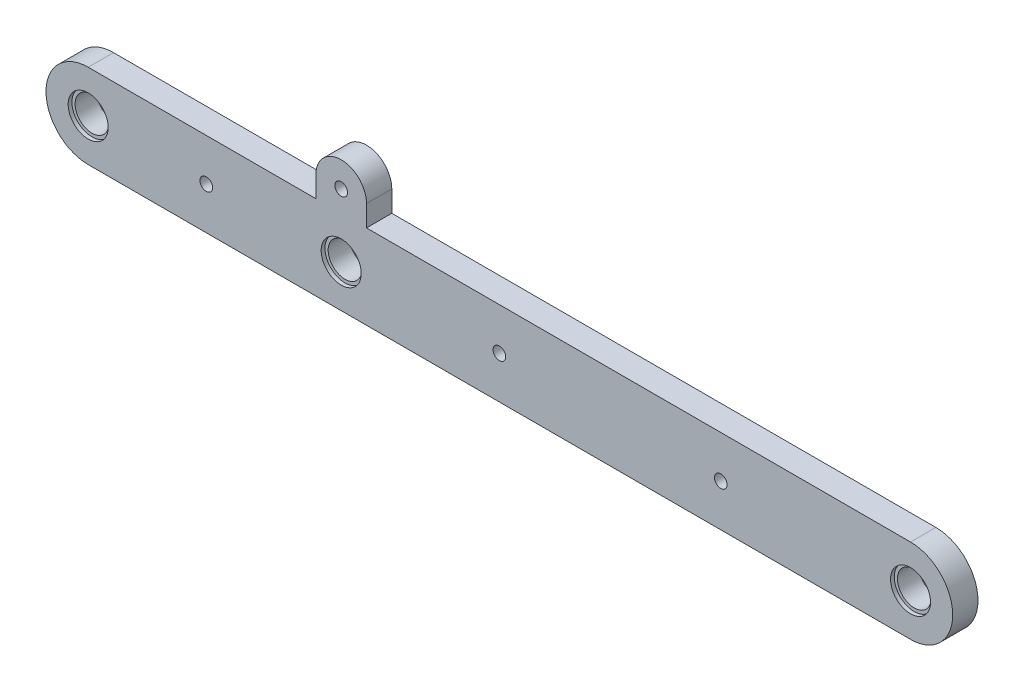
ISO-10303-21;
HEADER;
FILE_DESCRIPTION(('STEP AP214'),'2;1');
FILE_NAME('part.step','',(''),(''),'','','');
FILE_SCHEMA(('AUTOMOTIVE_DESIGN { 1 0 10303 214 1 1 1 1 }'));
ENDSEC;
DATA;
#1=APPLICATION_CONTEXT('core data for automotive mechanical design processes');
#2=APPLICATION_PROTOCOL_DEFINITION('international standard','automotive_design',2000,#1);
#3=PRODUCT_CONTEXT('',#1,'mechanical');
#4=PRODUCT('Part','Part','',(#3));
#5=PRODUCT_RELATED_PRODUCT_CATEGORY('part','',(#4));
#6=PRODUCT_DEFINITION_FORMATION('','',#4);
#7=PRODUCT_DEFINITION_CONTEXT('part definition',#1,'design');
#8=PRODUCT_DEFINITION('design','',#6,#7);
#9=PRODUCT_DEFINITION_SHAPE('','',#8);
#10=(LENGTH_UNIT() NAMED_UNIT(*) SI_UNIT(.MILLI.,.METRE.));
#11=(NAMED_UNIT(*) PLANE_ANGLE_UNIT() SI_UNIT($,.RADIAN.));
#12=(NAMED_UNIT(*) SI_UNIT($,.STERADIAN.) SOLID_ANGLE_UNIT());
#13=UNCERTAINTY_MEASURE_WITH_UNIT(LENGTH_MEASURE(1.E-05),#10,'distance_accuracy_value','');
#14=(GEOMETRIC_REPRESENTATION_CONTEXT(3) GLOBAL_UNCERTAINTY_ASSIGNED_CONTEXT((#13)) GLOBAL_UNIT_ASSIGNED_CONTEXT((#10,
#11,#12)) REPRESENTATION_CONTEXT('',''));
#15=CARTESIAN_POINT('',(0.,0.,0.));
#16=DIRECTION('',(0.,0.,1.));
#17=DIRECTION('',(1.,0.,0.));
#18=AXIS2_PLACEMENT_3D('',#15,#16,#17);
#19=CARTESIAN_POINT('',(6.,0.,6.));
#20=DIRECTION('',(-1.,0.,0.));
#21=DIRECTION('',(0.,-1.,0.));
#22=AXIS2_PLACEMENT_3D('',#19,#20,#21);
#23=PLANE('',#22);
#24=DIRECTION('',(0.,1.,0.));
#25=VECTOR('',#24,1.);
#26=CARTESIAN_POINT('',(6.,0.,0.));
#27=LINE('',#26,#25);
#28=CARTESIAN_POINT('',(6.,10.,0.));
#29=VERTEX_POINT('',#28);
#30=CARTESIAN_POINT('',(6.,15.,0.));
#31=VERTEX_POINT('',#30);
#32=EDGE_CURVE('E231',#29,#31,#27,.T.);
#33=ORIENTED_EDGE('',*,*,#32,.T.);
#34=DIRECTION('',(0.,0.,-1.));
#35=VECTOR('',#34,1.);
#36=CARTESIAN_POINT('',(6.,15.,6.));
#37=LINE('',#36,#35);
#38=CARTESIAN_POINT('',(6.,15.,6.));
#39=VERTEX_POINT('',#38);
#40=EDGE_CURVE('E176',#39,#31,#37,.T.);
#41=ORIENTED_EDGE('',*,*,#40,.F.);
#42=DIRECTION('',(0.,1.,0.));
#43=VECTOR('',#42,1.);
#44=CARTESIAN_POINT('',(6.,0.,6.));
#45=LINE('',#44,#43);
#46=CARTESIAN_POINT('',(6.,10.,6.));
#47=VERTEX_POINT('',#46);
#48=EDGE_CURVE('E286',#47,#39,#45,.T.);
#49=ORIENTED_EDGE('',*,*,#48,.F.);
#50=DIRECTION('',(0.,0.,-1.));
#51=VECTOR('',#50,1.);
#52=CARTESIAN_POINT('',(6.,10.,6.));
#53=LINE('',#52,#51);
#54=EDGE_CURVE('E12',#47,#29,#53,.T.);
#55=ORIENTED_EDGE('',*,*,#54,.T.);
#56=EDGE_LOOP('',(#33,#41,#49,#55));
#57=FACE_BOUND('',#56,.T.);
#58=ADVANCED_FACE('F166',(#57),#23,.F.);
#59=CARTESIAN_POINT('',(0.,15.,6.));
#60=DIRECTION('',(0.,0.,-1.));
#61=DIRECTION('',(-1.,0.,0.));
#62=AXIS2_PLACEMENT_3D('',#59,#60,#61);
#63=CYLINDRICAL_SURFACE('',#62,6.);
#64=CARTESIAN_POINT('',(0.,15.,0.));
#65=DIRECTION('',(0.,0.,1.));
#66=DIRECTION('',(1.,0.,0.));
#67=AXIS2_PLACEMENT_3D('',#64,#65,#66);
#68=CIRCLE('',#67,6.);
#69=CARTESIAN_POINT('',(-6.,15.,0.));
#70=VERTEX_POINT('',#69);
#71=EDGE_CURVE('E272',#31,#70,#68,.T.);
#72=ORIENTED_EDGE('',*,*,#71,.T.);
#73=DIRECTION('',(0.,0.,-1.));
#74=VECTOR('',#73,1.);
#75=CARTESIAN_POINT('',(-6.,15.,6.));
#76=LINE('',#75,#74);
#77=CARTESIAN_POINT('',(-6.,15.,6.));
#78=VERTEX_POINT('',#77);
#79=EDGE_CURVE('E254',#78,#70,#76,.T.);
#80=ORIENTED_EDGE('',*,*,#79,.F.);
#81=CARTESIAN_POINT('',(0.,15.,6.));
#82=DIRECTION('',(0.,0.,1.));
#83=DIRECTION('',(1.,0.,0.));
#84=AXIS2_PLACEMENT_3D('',#81,#82,#83);
#85=CIRCLE('',#84,6.);
#86=EDGE_CURVE('E283',#39,#78,#85,.T.);
#87=ORIENTED_EDGE('',*,*,#86,.F.);
#88=ORIENTED_EDGE('',*,*,#40,.T.);
#89=EDGE_LOOP('',(#72,#80,#87,#88));
#90=FACE_BOUND('',#89,.T.);
#91=ADVANCED_FACE('F414',(#90),#63,.T.);
#92=CARTESIAN_POINT('',(-6.,0.,6.));
#93=DIRECTION('',(-1.,0.,0.));
#94=DIRECTION('',(0.,-1.,0.));
#95=AXIS2_PLACEMENT_3D('',#92,#93,#94);
#96=PLANE('',#95);
#97=DIRECTION('',(0.,1.,0.));
#98=VECTOR('',#97,1.);
#99=CARTESIAN_POINT('',(-6.,0.,0.));
#100=LINE('',#99,#98);
#101=CARTESIAN_POINT('',(-6.,10.,0.));
#102=VERTEX_POINT('',#101);
#103=EDGE_CURVE('E269',#102,#70,#100,.T.);
#104=ORIENTED_EDGE('',*,*,#103,.F.);
#105=DIRECTION('',(0.,0.,-1.));
#106=VECTOR('',#105,1.);
#107=CARTESIAN_POINT('',(-6.,10.,6.));
#108=LINE('',#107,#106);
#109=CARTESIAN_POINT('',(-6.,10.,6.));
#110=VERTEX_POINT('',#109);
#111=EDGE_CURVE('E256',#110,#102,#108,.T.);
#112=ORIENTED_EDGE('',*,*,#111,.F.);
#113=DIRECTION('',(0.,1.,0.));
#114=VECTOR('',#113,1.);
#115=CARTESIAN_POINT('',(-6.,0.,6.));
#116=LINE('',#115,#114);
#117=EDGE_CURVE('E280',#110,#78,#116,.T.);
#118=ORIENTED_EDGE('',*,*,#117,.T.);
#119=ORIENTED_EDGE('',*,*,#79,.T.);
#120=EDGE_LOOP('',(#104,#112,#118,#119));
#121=FACE_BOUND('',#120,.T.);
#122=ADVANCED_FACE('F377',(#121),#96,.T.);
#123=CARTESIAN_POINT('',(135.,0.,6.));
#124=DIRECTION('',(0.,0.,-1.));
#125=DIRECTION('',(-1.,0.,0.));
#126=AXIS2_PLACEMENT_3D('',#123,#124,#125);
#127=CYLINDRICAL_SURFACE('',#126,10.);
#128=CARTESIAN_POINT('',(135.,0.,0.));
#129=DIRECTION('',(0.,0.,1.));
#130=DIRECTION('',(1.,0.,0.));
#131=AXIS2_PLACEMENT_3D('',#128,#129,#130);
#132=CIRCLE('',#131,10.);
#133=CARTESIAN_POINT('',(135.,-10.,0.));
#134=VERTEX_POINT('',#133);
#135=CARTESIAN_POINT('',(135.,10.,0.));
#136=VERTEX_POINT('',#135);
#137=EDGE_CURVE('E229',#134,#136,#132,.T.);
#138=ORIENTED_EDGE('',*,*,#137,.T.);
#139=DIRECTION('',(0.,0.,-1.));
#140=VECTOR('',#139,1.);
#141=CARTESIAN_POINT('',(135.,10.,6.));
#142=LINE('',#141,#140);
#143=CARTESIAN_POINT('',(135.,10.,6.));
#144=VERTEX_POINT('',#143);
#145=EDGE_CURVE('E237',#144,#136,#142,.T.);
#146=ORIENTED_EDGE('',*,*,#145,.F.);
#147=CARTESIAN_POINT('',(135.,0.,6.));
#148=DIRECTION('',(0.,0.,1.));
#149=DIRECTION('',(1.,0.,0.));
#150=AXIS2_PLACEMENT_3D('',#147,#148,#149);
#151=CIRCLE('',#150,10.);
#152=CARTESIAN_POINT('',(135.,-10.,6.));
#153=VERTEX_POINT('',#152);
#154=EDGE_CURVE('E234',#153,#144,#151,.T.);
#155=ORIENTED_EDGE('',*,*,#154,.F.);
#156=DIRECTION('',(0.,0.,-1.));
#157=VECTOR('',#156,1.);
#158=CARTESIAN_POINT('',(135.,-10.,6.));
#159=LINE('',#158,#157);
#160=EDGE_CURVE('E170',#153,#134,#159,.T.);
#161=ORIENTED_EDGE('',*,*,#160,.T.);
#162=EDGE_LOOP('',(#138,#146,#155,#161));
#163=FACE_BOUND('',#162,.T.);
#164=ADVANCED_FACE('F168',(#163),#127,.T.);
#165=CARTESIAN_POINT('',(0.,10.,6.));
#166=DIRECTION('',(0.,1.,0.));
#167=DIRECTION('',(0.,0.,1.));
#168=AXIS2_PLACEMENT_3D('',#165,#166,#167);
#169=PLANE('',#168);
#170=ORIENTED_EDGE('',*,*,#54,.F.);
#171=DIRECTION('',(1.,0.,0.));
#172=VECTOR('',#171,1.);
#173=CARTESIAN_POINT('',(0.,10.,6.));
#174=LINE('',#173,#172);
#175=EDGE_CURVE('E240',#47,#144,#174,.T.);
#176=ORIENTED_EDGE('',*,*,#175,.T.);
#177=ORIENTED_EDGE('',*,*,#145,.T.);
#178=DIRECTION('',(1.,0.,0.));
#179=VECTOR('',#178,1.);
#180=CARTESIAN_POINT('',(0.,10.,0.));
#181=LINE('',#180,#179);
#182=EDGE_CURVE('E225',#29,#136,#181,.T.);
#183=ORIENTED_EDGE('',*,*,#182,.F.);
#184=EDGE_LOOP('',(#170,#176,#177,#183));
#185=FACE_BOUND('',#184,.T.);
#186=ADVANCED_FACE('F238',(#185),#169,.T.);
#187=CARTESIAN_POINT('',(-60.,0.,6.));
#188=DIRECTION('',(0.,0.,-1.));
#189=DIRECTION('',(-1.,0.,0.));
#190=AXIS2_PLACEMENT_3D('',#187,#188,#189);
#191=CYLINDRICAL_SURFACE('',#190,9.99999999999999);
#192=CARTESIAN_POINT('',(-60.,0.,0.));
#193=DIRECTION('',(0.,0.,1.));
#194=DIRECTION('',(1.,0.,0.));
#195=AXIS2_PLACEMENT_3D('',#192,#193,#194);
#196=CIRCLE('',#195,9.99999999999999);
#197=CARTESIAN_POINT('',(-60.,9.99999999999999,0.));
#198=VERTEX_POINT('',#197);
#199=CARTESIAN_POINT('',(-60.,-10.,0.));
#200=VERTEX_POINT('',#199);
#201=EDGE_CURVE('E263',#198,#200,#196,.T.);
#202=ORIENTED_EDGE('',*,*,#201,.T.);
#203=DIRECTION('',(0.,0.,-1.));
#204=VECTOR('',#203,1.);
#205=CARTESIAN_POINT('',(-60.,-10.,6.));
#206=LINE('',#205,#204);
#207=CARTESIAN_POINT('',(-60.,-10.,6.));
#208=VERTEX_POINT('',#207);
#209=EDGE_CURVE('E261',#208,#200,#206,.T.);
#210=ORIENTED_EDGE('',*,*,#209,.F.);
#211=CARTESIAN_POINT('',(-60.,0.,6.));
#212=DIRECTION('',(0.,0.,1.));
#213=DIRECTION('',(1.,0.,0.));
#214=AXIS2_PLACEMENT_3D('',#211,#212,#213);
#215=CIRCLE('',#214,9.99999999999999);
#216=CARTESIAN_POINT('',(-60.,9.99999999999999,6.));
#217=VERTEX_POINT('',#216);
#218=EDGE_CURVE('E185',#217,#208,#215,.T.);
#219=ORIENTED_EDGE('',*,*,#218,.F.);
#220=DIRECTION('',(0.,0.,-1.));
#221=VECTOR('',#220,1.);
#222=CARTESIAN_POINT('',(-60.,9.99999999999999,6.));
#223=LINE('',#222,#221);
#224=EDGE_CURVE('E258',#217,#198,#223,.T.);
#225=ORIENTED_EDGE('',*,*,#224,.T.);
#226=EDGE_LOOP('',(#202,#210,#219,#225));
#227=FACE_BOUND('',#226,.T.);
#228=ADVANCED_FACE('F397',(#227),#191,.T.);
#229=CARTESIAN_POINT('',(0.,-10.,6.));
#230=DIRECTION('',(0.,-1.,0.));
#231=DIRECTION('',(1.,0.,0.));
#232=AXIS2_PLACEMENT_3D('',#229,#230,#231);
#233=PLANE('',#232);
#234=DIRECTION('',(-1.,0.,0.));
#235=VECTOR('',#234,1.);
#236=CARTESIAN_POINT('',(0.,-10.,0.));
#237=LINE('',#236,#235);
#238=EDGE_CURVE('E218',#134,#200,#237,.T.);
#239=ORIENTED_EDGE('',*,*,#238,.F.);
#240=ORIENTED_EDGE('',*,*,#160,.F.);
#241=DIRECTION('',(-1.,0.,0.));
#242=VECTOR('',#241,1.);
#243=CARTESIAN_POINT('',(0.,-10.,6.));
#244=LINE('',#243,#242);
#245=EDGE_CURVE('E266',#153,#208,#244,.T.);
#246=ORIENTED_EDGE('',*,*,#245,.T.);
#247=ORIENTED_EDGE('',*,*,#209,.T.);
#248=EDGE_LOOP('',(#239,#240,#246,#247));
#249=FACE_BOUND('',#248,.T.);
#250=ADVANCED_FACE('F395',(#249),#233,.T.);
#251=CARTESIAN_POINT('',(0.,10.,6.));
#252=DIRECTION('',(0.,-1.,0.));
#253=DIRECTION('',(1.,0.,0.));
#254=AXIS2_PLACEMENT_3D('',#251,#252,#253);
#255=PLANE('',#254);
#256=DIRECTION('',(-1.,0.,0.));
#257=VECTOR('',#256,1.);
#258=CARTESIAN_POINT('',(0.,10.,0.));
#259=LINE('',#258,#257);
#260=EDGE_CURVE('E267',#102,#198,#259,.T.);
#261=ORIENTED_EDGE('',*,*,#260,.T.);
#262=ORIENTED_EDGE('',*,*,#224,.F.);
#263=DIRECTION('',(-1.,0.,0.));
#264=VECTOR('',#263,1.);
#265=CARTESIAN_POINT('',(0.,10.,6.));
#266=LINE('',#265,#264);
#267=EDGE_CURVE('E278',#110,#217,#266,.T.);
#268=ORIENTED_EDGE('',*,*,#267,.F.);
#269=ORIENTED_EDGE('',*,*,#111,.T.);
#270=EDGE_LOOP('',(#261,#262,#268,#269));
#271=FACE_BOUND('',#270,.T.);
#272=ADVANCED_FACE('F361',(#271),#255,.F.);
#273=CARTESIAN_POINT('',(0.,0.,0.));
#274=DIRECTION('',(0.,0.,1.));
#275=DIRECTION('',(1.,0.,0.));
#276=AXIS2_PLACEMENT_3D('',#273,#274,#275);
#277=PLANE('',#276);
#278=CARTESIAN_POINT('',(0.,15.,0.));
#279=DIRECTION('',(0.,0.,1.));
#280=DIRECTION('',(1.,0.,0.));
#281=AXIS2_PLACEMENT_3D('',#278,#279,#280);
#282=CIRCLE('',#281,1.5);
#283=CARTESIAN_POINT('',(1.5,15.,0.));
#284=VERTEX_POINT('',#283);
#285=EDGE_CURVE('E323',#284,#284,#282,.T.);
#286=ORIENTED_EDGE('',*,*,#285,.T.);
#287=EDGE_LOOP('',(#286));
#288=FACE_BOUND('',#287,.T.);
#289=CARTESIAN_POINT('',(-32.,0.,0.));
#290=DIRECTION('',(0.,0.,1.));
#291=DIRECTION('',(1.,0.,0.));
#292=AXIS2_PLACEMENT_3D('',#289,#290,#291);
#293=CIRCLE('',#292,1.5);
#294=CARTESIAN_POINT('',(-30.5,0.,0.));
#295=VERTEX_POINT('',#294);
#296=EDGE_CURVE('E326',#295,#295,#293,.T.);
#297=ORIENTED_EDGE('',*,*,#296,.T.);
#298=EDGE_LOOP('',(#297));
#299=FACE_BOUND('',#298,.T.);
#300=CARTESIAN_POINT('',(90.,0.,0.));
#301=DIRECTION('',(0.,0.,1.));
#302=DIRECTION('',(1.,0.,0.));
#303=AXIS2_PLACEMENT_3D('',#300,#301,#302);
#304=CIRCLE('',#303,1.5);
#305=CARTESIAN_POINT('',(91.5,0.,0.));
#306=VERTEX_POINT('',#305);
#307=EDGE_CURVE('E329',#306,#306,#304,.T.);
#308=ORIENTED_EDGE('',*,*,#307,.T.);
#309=EDGE_LOOP('',(#308));
#310=FACE_BOUND('',#309,.T.);
#311=CARTESIAN_POINT('',(37.5,0.,0.));
#312=DIRECTION('',(0.,0.,1.));
#313=DIRECTION('',(1.,0.,0.));
#314=AXIS2_PLACEMENT_3D('',#311,#312,#313);
#315=CIRCLE('',#314,1.5);
#316=CARTESIAN_POINT('',(39.,0.,0.));
#317=VERTEX_POINT('',#316);
#318=EDGE_CURVE('E332',#317,#317,#315,.T.);
#319=ORIENTED_EDGE('',*,*,#318,.T.);
#320=EDGE_LOOP('',(#319));
#321=FACE_BOUND('',#320,.T.);
#322=CARTESIAN_POINT('',(135.,0.,0.));
#323=DIRECTION('',(0.,0.,1.));
#324=DIRECTION('',(1.,0.,0.));
#325=AXIS2_PLACEMENT_3D('',#322,#323,#324);
#326=CIRCLE('',#325,4.);
#327=CARTESIAN_POINT('',(139.,0.,0.));
#328=VERTEX_POINT('',#327);
#329=EDGE_CURVE('E311',#328,#328,#326,.T.);
#330=ORIENTED_EDGE('',*,*,#329,.T.);
#331=EDGE_LOOP('',(#330));
#332=FACE_BOUND('',#331,.T.);
#333=CARTESIAN_POINT('',(-60.,0.,0.));
#334=DIRECTION('',(0.,0.,1.));
#335=DIRECTION('',(1.,0.,0.));
#336=AXIS2_PLACEMENT_3D('',#333,#334,#335);
#337=CIRCLE('',#336,4.);
#338=CARTESIAN_POINT('',(-56.,0.,0.));
#339=VERTEX_POINT('',#338);
#340=EDGE_CURVE('E299',#339,#339,#337,.T.);
#341=ORIENTED_EDGE('',*,*,#340,.T.);
#342=EDGE_LOOP('',(#341));
#343=FACE_BOUND('',#342,.T.);
#344=CARTESIAN_POINT('',(0.,0.,0.));
#345=DIRECTION('',(0.,0.,1.));
#346=DIRECTION('',(1.,0.,0.));
#347=AXIS2_PLACEMENT_3D('',#344,#345,#346);
#348=CIRCLE('',#347,4.);
#349=CARTESIAN_POINT('',(4.,0.,0.));
#350=VERTEX_POINT('',#349);
#351=EDGE_CURVE('E244',#350,#350,#348,.T.);
#352=ORIENTED_EDGE('',*,*,#351,.T.);
#353=EDGE_LOOP('',(#352));
#354=FACE_BOUND('',#353,.T.);
#355=ORIENTED_EDGE('',*,*,#32,.F.);
#356=ORIENTED_EDGE('',*,*,#182,.T.);
#357=ORIENTED_EDGE('',*,*,#137,.F.);
#358=ORIENTED_EDGE('',*,*,#238,.T.);
#359=ORIENTED_EDGE('',*,*,#201,.F.);
#360=ORIENTED_EDGE('',*,*,#260,.F.);
#361=ORIENTED_EDGE('',*,*,#103,.T.);
#362=ORIENTED_EDGE('',*,*,#71,.F.);
#363=EDGE_LOOP('',(#355,#356,#357,#358,#359,#360,#361,#362));
#364=FACE_BOUND('',#363,.T.);
#365=ADVANCED_FACE('F227',(#288,#299,#310,#321,#332,#343,#354,#364),#277,.F.);
#366=CARTESIAN_POINT('',(0.,0.,6.));
#367=DIRECTION('',(0.,0.,1.));
#368=DIRECTION('',(1.,0.,0.));
#369=AXIS2_PLACEMENT_3D('',#366,#367,#368);
#370=PLANE('',#369);
#371=CARTESIAN_POINT('',(0.,15.,6.));
#372=DIRECTION('',(0.,0.,-1.));
#373=DIRECTION('',(-1.,0.,0.));
#374=AXIS2_PLACEMENT_3D('',#371,#372,#373);
#375=CIRCLE('',#374,1.5);
#376=CARTESIAN_POINT('',(-1.5,15.,6.));
#377=VERTEX_POINT('',#376);
#378=EDGE_CURVE('E339',#377,#377,#375,.T.);
#379=ORIENTED_EDGE('',*,*,#378,.T.);
#380=EDGE_LOOP('',(#379));
#381=FACE_BOUND('',#380,.T.);
#382=CARTESIAN_POINT('',(-32.,0.,6.));
#383=DIRECTION('',(0.,0.,-1.));
#384=DIRECTION('',(-1.,0.,0.));
#385=AXIS2_PLACEMENT_3D('',#382,#383,#384);
#386=CIRCLE('',#385,1.5);
#387=CARTESIAN_POINT('',(-33.5,0.,6.));
#388=VERTEX_POINT('',#387);
#389=EDGE_CURVE('E342',#388,#388,#386,.T.);
#390=ORIENTED_EDGE('',*,*,#389,.T.);
#391=EDGE_LOOP('',(#390));
#392=FACE_BOUND('',#391,.T.);
#393=CARTESIAN_POINT('',(90.,0.,6.));
#394=DIRECTION('',(0.,0.,-1.));
#395=DIRECTION('',(-1.,0.,0.));
#396=AXIS2_PLACEMENT_3D('',#393,#394,#395);
#397=CIRCLE('',#396,1.5);
#398=CARTESIAN_POINT('',(88.5,0.,6.));
#399=VERTEX_POINT('',#398);
#400=EDGE_CURVE('E338',#399,#399,#397,.T.);
#401=ORIENTED_EDGE('',*,*,#400,.T.);
#402=EDGE_LOOP('',(#401));
#403=FACE_BOUND('',#402,.T.);
#404=CARTESIAN_POINT('',(37.5,0.,6.));
#405=DIRECTION('',(0.,0.,-1.));
#406=DIRECTION('',(-1.,0.,0.));
#407=AXIS2_PLACEMENT_3D('',#404,#405,#406);
#408=CIRCLE('',#407,1.5);
#409=CARTESIAN_POINT('',(36.,0.,6.));
#410=VERTEX_POINT('',#409);
#411=EDGE_CURVE('E335',#410,#410,#408,.T.);
#412=ORIENTED_EDGE('',*,*,#411,.T.);
#413=EDGE_LOOP('',(#412));
#414=FACE_BOUND('',#413,.T.);
#415=CARTESIAN_POINT('',(135.,0.,6.));
#416=DIRECTION('',(0.,0.,1.));
#417=DIRECTION('',(1.,0.,0.));
#418=AXIS2_PLACEMENT_3D('',#415,#416,#417);
#419=CIRCLE('',#418,4.75);
#420=CARTESIAN_POINT('',(139.75,0.,6.));
#421=VERTEX_POINT('',#420);
#422=EDGE_CURVE('E320',#421,#421,#419,.T.);
#423=ORIENTED_EDGE('',*,*,#422,.F.);
#424=EDGE_LOOP('',(#423));
#425=FACE_BOUND('',#424,.T.);
#426=CARTESIAN_POINT('',(-60.,0.,6.));
#427=DIRECTION('',(0.,0.,1.));
#428=DIRECTION('',(1.,0.,0.));
#429=AXIS2_PLACEMENT_3D('',#426,#427,#428);
#430=CIRCLE('',#429,4.75);
#431=CARTESIAN_POINT('',(-55.25,0.,6.));
#432=VERTEX_POINT('',#431);
#433=EDGE_CURVE('E308',#432,#432,#430,.T.);
#434=ORIENTED_EDGE('',*,*,#433,.F.);
#435=EDGE_LOOP('',(#434));
#436=FACE_BOUND('',#435,.T.);
#437=CARTESIAN_POINT('',(0.,0.,6.));
#438=DIRECTION('',(0.,0.,1.));
#439=DIRECTION('',(1.,0.,0.));
#440=AXIS2_PLACEMENT_3D('',#437,#438,#439);
#441=CIRCLE('',#440,4.75);
#442=CARTESIAN_POINT('',(4.75,0.,6.));
#443=VERTEX_POINT('',#442);
#444=EDGE_CURVE('E296',#443,#443,#441,.T.);
#445=ORIENTED_EDGE('',*,*,#444,.F.);
#446=EDGE_LOOP('',(#445));
#447=FACE_BOUND('',#446,.T.);
#448=ORIENTED_EDGE('',*,*,#245,.F.);
#449=ORIENTED_EDGE('',*,*,#154,.T.);
#450=ORIENTED_EDGE('',*,*,#175,.F.);
#451=ORIENTED_EDGE('',*,*,#48,.T.);
#452=ORIENTED_EDGE('',*,*,#86,.T.);
#453=ORIENTED_EDGE('',*,*,#117,.F.);
#454=ORIENTED_EDGE('',*,*,#267,.T.);
#455=ORIENTED_EDGE('',*,*,#218,.T.);
#456=EDGE_LOOP('',(#448,#449,#450,#451,#452,#453,#454,#455));
#457=FACE_BOUND('',#456,.T.);
#458=ADVANCED_FACE('F348',(#381,#392,#403,#414,#425,#436,#447,#457),#370,.T.);
#459=CARTESIAN_POINT('',(0.,0.,6.));
#460=DIRECTION('',(0.,0.,1.));
#461=DIRECTION('',(1.,0.,0.));
#462=AXIS2_PLACEMENT_3D('',#459,#460,#461);
#463=CYLINDRICAL_SURFACE('',#462,4.);
#464=ORIENTED_EDGE('',*,*,#351,.F.);
#465=EDGE_LOOP('',(#464));
#466=FACE_BOUND('',#465,.T.);
#467=CARTESIAN_POINT('',(0.,0.,5.1));
#468=DIRECTION('',(0.,0.,1.));
#469=DIRECTION('',(1.,0.,0.));
#470=AXIS2_PLACEMENT_3D('',#467,#468,#469);
#471=CIRCLE('',#470,4.);
#472=CARTESIAN_POINT('',(4.,0.,5.1));
#473=VERTEX_POINT('',#472);
#474=EDGE_CURVE('E247',#473,#473,#471,.T.);
#475=ORIENTED_EDGE('',*,*,#474,.T.);
#476=EDGE_LOOP('',(#475));
#477=FACE_BOUND('',#476,.T.);
#478=ADVANCED_FACE('F372',(#466,#477),#463,.F.);
#479=CARTESIAN_POINT('',(4.,0.,5.1));
#480=DIRECTION('',(0.,0.,-1.));
#481=DIRECTION('',(-1.,0.,0.));
#482=AXIS2_PLACEMENT_3D('',#479,#480,#481);
#483=PLANE('',#482);
#484=ORIENTED_EDGE('',*,*,#474,.F.);
#485=EDGE_LOOP('',(#484));
#486=FACE_BOUND('',#485,.T.);
#487=CARTESIAN_POINT('',(0.,0.,5.1));
#488=DIRECTION('',(0.,0.,1.));
#489=DIRECTION('',(1.,0.,0.));
#490=AXIS2_PLACEMENT_3D('',#487,#488,#489);
#491=CIRCLE('',#490,4.75);
#492=CARTESIAN_POINT('',(4.75,0.,5.1));
#493=VERTEX_POINT('',#492);
#494=EDGE_CURVE('E293',#493,#493,#491,.T.);
#495=ORIENTED_EDGE('',*,*,#494,.T.);
#496=EDGE_LOOP('',(#495));
#497=FACE_BOUND('',#496,.T.);
#498=ADVANCED_FACE('F375',(#486,#497),#483,.F.);
#499=CARTESIAN_POINT('',(0.,0.,6.));
#500=DIRECTION('',(0.,0.,1.));
#501=DIRECTION('',(1.,0.,0.));
#502=AXIS2_PLACEMENT_3D('',#499,#500,#501);
#503=CYLINDRICAL_SURFACE('',#502,4.75);
#504=ORIENTED_EDGE('',*,*,#494,.F.);
#505=EDGE_LOOP('',(#504));
#506=FACE_BOUND('',#505,.T.);
#507=ORIENTED_EDGE('',*,*,#444,.T.);
#508=EDGE_LOOP('',(#507));
#509=FACE_BOUND('',#508,.T.);
#510=ADVANCED_FACE('F382',(#506,#509),#503,.F.);
#511=CARTESIAN_POINT('',(-60.,0.,6.));
#512=DIRECTION('',(0.,0.,1.));
#513=DIRECTION('',(1.,0.,0.));
#514=AXIS2_PLACEMENT_3D('',#511,#512,#513);
#515=CYLINDRICAL_SURFACE('',#514,4.);
#516=ORIENTED_EDGE('',*,*,#340,.F.);
#517=EDGE_LOOP('',(#516));
#518=FACE_BOUND('',#517,.T.);
#519=CARTESIAN_POINT('',(-60.,0.,5.1));
#520=DIRECTION('',(0.,0.,1.));
#521=DIRECTION('',(1.,0.,0.));
#522=AXIS2_PLACEMENT_3D('',#519,#520,#521);
#523=CIRCLE('',#522,4.);
#524=CARTESIAN_POINT('',(-56.,0.,5.1));
#525=VERTEX_POINT('',#524);
#526=EDGE_CURVE('E302',#525,#525,#523,.T.);
#527=ORIENTED_EDGE('',*,*,#526,.T.);
#528=EDGE_LOOP('',(#527));
#529=FACE_BOUND('',#528,.T.);
#530=ADVANCED_FACE('F388',(#518,#529),#515,.F.);
#531=CARTESIAN_POINT('',(-56.,0.,5.1));
#532=DIRECTION('',(0.,0.,-1.));
#533=DIRECTION('',(-1.,0.,0.));
#534=AXIS2_PLACEMENT_3D('',#531,#532,#533);
#535=PLANE('',#534);
#536=ORIENTED_EDGE('',*,*,#526,.F.);
#537=EDGE_LOOP('',(#536));
#538=FACE_BOUND('',#537,.T.);
#539=CARTESIAN_POINT('',(-60.,0.,5.1));
#540=DIRECTION('',(0.,0.,1.));
#541=DIRECTION('',(1.,0.,0.));
#542=AXIS2_PLACEMENT_3D('',#539,#540,#541);
#543=CIRCLE('',#542,4.75);
#544=CARTESIAN_POINT('',(-55.25,0.,5.1));
#545=VERTEX_POINT('',#544);
#546=EDGE_CURVE('E305',#545,#545,#543,.T.);
#547=ORIENTED_EDGE('',*,*,#546,.T.);
#548=EDGE_LOOP('',(#547));
#549=FACE_BOUND('',#548,.T.);
#550=ADVANCED_FACE('F444',(#538,#549),#535,.F.);
#551=CARTESIAN_POINT('',(-60.,0.,6.));
#552=DIRECTION('',(0.,0.,1.));
#553=DIRECTION('',(1.,0.,0.));
#554=AXIS2_PLACEMENT_3D('',#551,#552,#553);
#555=CYLINDRICAL_SURFACE('',#554,4.75);
#556=ORIENTED_EDGE('',*,*,#546,.F.);
#557=EDGE_LOOP('',(#556));
#558=FACE_BOUND('',#557,.T.);
#559=ORIENTED_EDGE('',*,*,#433,.T.);
#560=EDGE_LOOP('',(#559));
#561=FACE_BOUND('',#560,.T.);
#562=ADVANCED_FACE('F448',(#558,#561),#555,.F.);
#563=CARTESIAN_POINT('',(135.,0.,6.));
#564=DIRECTION('',(0.,0.,1.));
#565=DIRECTION('',(1.,0.,0.));
#566=AXIS2_PLACEMENT_3D('',#563,#564,#565);
#567=CYLINDRICAL_SURFACE('',#566,4.);
#568=ORIENTED_EDGE('',*,*,#329,.F.);
#569=EDGE_LOOP('',(#568));
#570=FACE_BOUND('',#569,.T.);
#571=CARTESIAN_POINT('',(135.,0.,5.1));
#572=DIRECTION('',(0.,0.,1.));
#573=DIRECTION('',(1.,0.,0.));
#574=AXIS2_PLACEMENT_3D('',#571,#572,#573);
#575=CIRCLE('',#574,4.);
#576=CARTESIAN_POINT('',(139.,0.,5.1));
#577=VERTEX_POINT('',#576);
#578=EDGE_CURVE('E314',#577,#577,#575,.T.);
#579=ORIENTED_EDGE('',*,*,#578,.T.);
#580=EDGE_LOOP('',(#579));
#581=FACE_BOUND('',#580,.T.);
#582=ADVANCED_FACE('F452',(#570,#581),#567,.F.);
#583=CARTESIAN_POINT('',(139.,0.,5.1));
#584=DIRECTION('',(0.,0.,-1.));
#585=DIRECTION('',(-1.,0.,0.));
#586=AXIS2_PLACEMENT_3D('',#583,#584,#585);
#587=PLANE('',#586);
#588=ORIENTED_EDGE('',*,*,#578,.F.);
#589=EDGE_LOOP('',(#588));
#590=FACE_BOUND('',#589,.T.);
#591=CARTESIAN_POINT('',(135.,0.,5.1));
#592=DIRECTION('',(0.,0.,1.));
#593=DIRECTION('',(1.,0.,0.));
#594=AXIS2_PLACEMENT_3D('',#591,#592,#593);
#595=CIRCLE('',#594,4.75);
#596=CARTESIAN_POINT('',(139.75,0.,5.1));
#597=VERTEX_POINT('',#596);
#598=EDGE_CURVE('E317',#597,#597,#595,.T.);
#599=ORIENTED_EDGE('',*,*,#598,.T.);
#600=EDGE_LOOP('',(#599));
#601=FACE_BOUND('',#600,.T.);
#602=ADVANCED_FACE('F456',(#590,#601),#587,.F.);
#603=CARTESIAN_POINT('',(135.,0.,6.));
#604=DIRECTION('',(0.,0.,1.));
#605=DIRECTION('',(1.,0.,0.));
#606=AXIS2_PLACEMENT_3D('',#603,#604,#605);
#607=CYLINDRICAL_SURFACE('',#606,4.75);
#608=ORIENTED_EDGE('',*,*,#598,.F.);
#609=EDGE_LOOP('',(#608));
#610=FACE_BOUND('',#609,.T.);
#611=ORIENTED_EDGE('',*,*,#422,.T.);
#612=EDGE_LOOP('',(#611));
#613=FACE_BOUND('',#612,.T.);
#614=ADVANCED_FACE('F460',(#610,#613),#607,.F.);
#615=CARTESIAN_POINT('',(37.5,0.,6.));
#616=DIRECTION('',(0.,0.,-1.));
#617=DIRECTION('',(-1.,0.,0.));
#618=AXIS2_PLACEMENT_3D('',#615,#616,#617);
#619=CYLINDRICAL_SURFACE('',#618,1.5);
#620=ORIENTED_EDGE('',*,*,#411,.F.);
#621=EDGE_LOOP('',(#620));
#622=FACE_BOUND('',#621,.T.);
#623=ORIENTED_EDGE('',*,*,#318,.F.);
#624=EDGE_LOOP('',(#623));
#625=FACE_BOUND('',#624,.T.);
#626=ADVANCED_FACE('F355',(#622,#625),#619,.F.);
#627=CARTESIAN_POINT('',(90.,0.,6.));
#628=DIRECTION('',(0.,0.,-1.));
#629=DIRECTION('',(-1.,0.,0.));
#630=AXIS2_PLACEMENT_3D('',#627,#628,#629);
#631=CYLINDRICAL_SURFACE('',#630,1.5);
#632=ORIENTED_EDGE('',*,*,#400,.F.);
#633=EDGE_LOOP('',(#632));
#634=FACE_BOUND('',#633,.T.);
#635=ORIENTED_EDGE('',*,*,#307,.F.);
#636=EDGE_LOOP('',(#635));
#637=FACE_BOUND('',#636,.T.);
#638=ADVANCED_FACE('F351',(#634,#637),#631,.F.);
#639=CARTESIAN_POINT('',(-32.,0.,6.));
#640=DIRECTION('',(0.,0.,-1.));
#641=DIRECTION('',(-1.,0.,0.));
#642=AXIS2_PLACEMENT_3D('',#639,#640,#641);
#643=CYLINDRICAL_SURFACE('',#642,1.5);
#644=ORIENTED_EDGE('',*,*,#389,.F.);
#645=EDGE_LOOP('',(#644));
#646=FACE_BOUND('',#645,.T.);
#647=ORIENTED_EDGE('',*,*,#296,.F.);
#648=EDGE_LOOP('',(#647));
#649=FACE_BOUND('',#648,.T.);
#650=ADVANCED_FACE('F354',(#646,#649),#643,.F.);
#651=CARTESIAN_POINT('',(0.,15.,6.));
#652=DIRECTION('',(0.,0.,-1.));
#653=DIRECTION('',(-1.,0.,0.));
#654=AXIS2_PLACEMENT_3D('',#651,#652,#653);
#655=CYLINDRICAL_SURFACE('',#654,1.5);
#656=ORIENTED_EDGE('',*,*,#378,.F.);
#657=EDGE_LOOP('',(#656));
#658=FACE_BOUND('',#657,.T.);
#659=ORIENTED_EDGE('',*,*,#285,.F.);
#660=EDGE_LOOP('',(#659));
#661=FACE_BOUND('',#660,.T.);
#662=ADVANCED_FACE('F468',(#658,#661),#655,.F.);
#663=CLOSED_SHELL('',(#58,#91,#122,#164,#186,#228,#250,#272,#365,#458,#478,#498,#510,#530,#550,
#562,#582,#602,#614,#626,#638,#650,#662));
#664=MANIFOLD_SOLID_BREP('B2',#663);
#665=ADVANCED_BREP_SHAPE_REPRESENTATION('',(#18,#664),#14);
#666=SHAPE_DEFINITION_REPRESENTATION(#9,#665);
ENDSEC;
END-ISO-10303-21;
